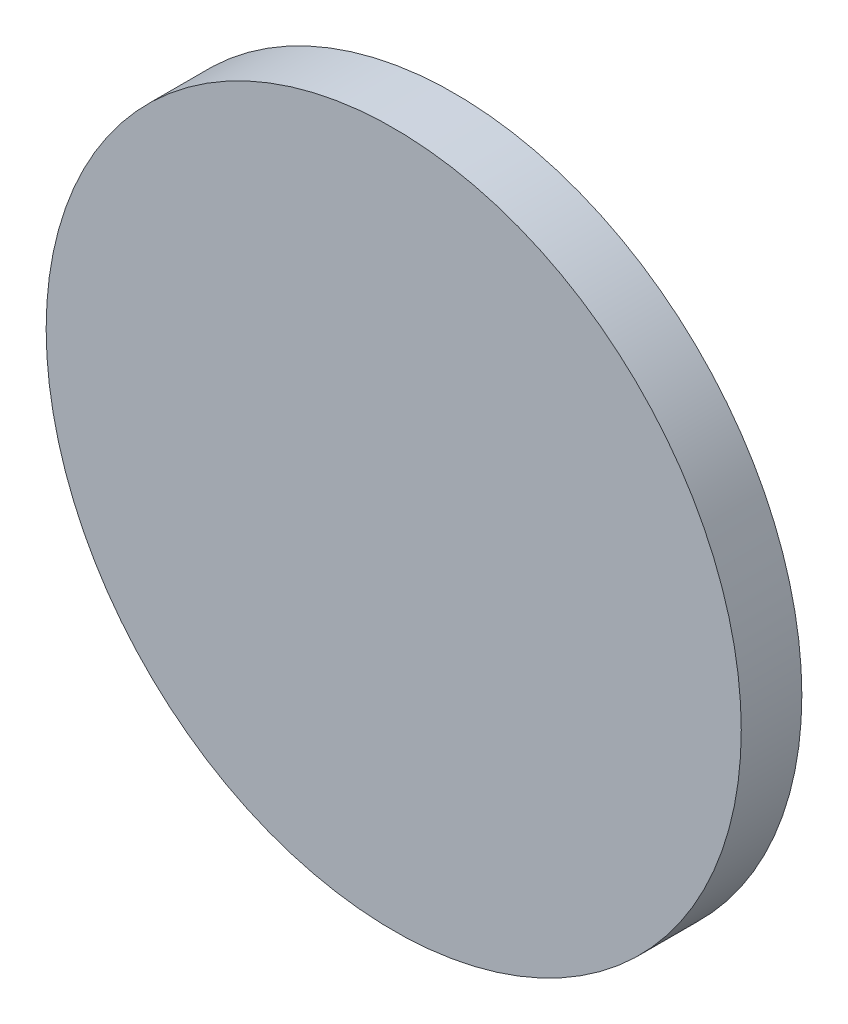
ISO-10303-21;
HEADER;
FILE_DESCRIPTION(('STEP AP214'),'2;1');
FILE_NAME('part.step','',(''),(''),'','','');
FILE_SCHEMA(('AUTOMOTIVE_DESIGN { 1 0 10303 214 1 1 1 1 }'));
ENDSEC;
DATA;
#1=APPLICATION_CONTEXT('core data for automotive mechanical design processes');
#2=APPLICATION_PROTOCOL_DEFINITION('international standard','automotive_design',2000,#1);
#3=PRODUCT_CONTEXT('',#1,'mechanical');
#4=PRODUCT('Part','Part','',(#3));
#5=PRODUCT_RELATED_PRODUCT_CATEGORY('part','',(#4));
#6=PRODUCT_DEFINITION_FORMATION('','',#4);
#7=PRODUCT_DEFINITION_CONTEXT('part definition',#1,'design');
#8=PRODUCT_DEFINITION('design','',#6,#7);
#9=PRODUCT_DEFINITION_SHAPE('','',#8);
#10=(LENGTH_UNIT() NAMED_UNIT(*) SI_UNIT(.MILLI.,.METRE.));
#11=(NAMED_UNIT(*) PLANE_ANGLE_UNIT() SI_UNIT($,.RADIAN.));
#12=(NAMED_UNIT(*) SI_UNIT($,.STERADIAN.) SOLID_ANGLE_UNIT());
#13=UNCERTAINTY_MEASURE_WITH_UNIT(LENGTH_MEASURE(1.E-05),#10,'distance_accuracy_value','');
#14=(GEOMETRIC_REPRESENTATION_CONTEXT(3) GLOBAL_UNCERTAINTY_ASSIGNED_CONTEXT((#13)) GLOBAL_UNIT_ASSIGNED_CONTEXT((#10,
#11,#12)) REPRESENTATION_CONTEXT('',''));
#15=CARTESIAN_POINT('',(0.,0.,0.));
#16=DIRECTION('',(0.,0.,1.));
#17=DIRECTION('',(1.,0.,0.));
#18=AXIS2_PLACEMENT_3D('',#15,#16,#17);
#19=CARTESIAN_POINT('',(0.,0.,-10.));
#20=DIRECTION('',(0.,0.,1.));
#21=DIRECTION('',(1.,0.,0.));
#22=AXIS2_PLACEMENT_3D('',#19,#20,#21);
#23=CYLINDRICAL_SURFACE('',#22,57.3785000000004);
#24=CARTESIAN_POINT('',(0.,0.,-10.));
#25=DIRECTION('',(0.,0.,1.));
#26=DIRECTION('',(1.,0.,0.));
#27=AXIS2_PLACEMENT_3D('',#24,#25,#26);
#28=CIRCLE('',#27,57.3785000000004);
#29=CARTESIAN_POINT('',(57.3785000000004,0.,-10.));
#30=VERTEX_POINT('',#29);
#31=EDGE_CURVE('E10',#30,#30,#28,.T.);
#32=ORIENTED_EDGE('',*,*,#31,.T.);
#33=EDGE_LOOP('',(#32));
#34=FACE_BOUND('',#33,.T.);
#35=CARTESIAN_POINT('',(0.,0.,0.));
#36=DIRECTION('',(0.,0.,1.));
#37=DIRECTION('',(1.,0.,0.));
#38=AXIS2_PLACEMENT_3D('',#35,#36,#37);
#39=CIRCLE('',#38,57.3785000000004);
#40=CARTESIAN_POINT('',(57.3785000000004,0.,0.));
#41=VERTEX_POINT('',#40);
#42=EDGE_CURVE('E33',#41,#41,#39,.T.);
#43=ORIENTED_EDGE('',*,*,#42,.F.);
#44=EDGE_LOOP('',(#43));
#45=FACE_BOUND('',#44,.T.);
#46=ADVANCED_FACE('F30',(#34,#45),#23,.T.);
#47=CARTESIAN_POINT('',(0.,0.,-10.));
#48=DIRECTION('',(0.,0.,1.));
#49=DIRECTION('',(1.,0.,0.));
#50=AXIS2_PLACEMENT_3D('',#47,#48,#49);
#51=PLANE('',#50);
#52=ORIENTED_EDGE('',*,*,#31,.F.);
#53=EDGE_LOOP('',(#52));
#54=FACE_BOUND('',#53,.T.);
#55=ADVANCED_FACE('F45',(#54),#51,.F.);
#56=CARTESIAN_POINT('',(0.,0.,0.));
#57=DIRECTION('',(0.,0.,1.));
#58=DIRECTION('',(1.,0.,0.));
#59=AXIS2_PLACEMENT_3D('',#56,#57,#58);
#60=PLANE('',#59);
#61=ORIENTED_EDGE('',*,*,#42,.T.);
#62=EDGE_LOOP('',(#61));
#63=FACE_BOUND('',#62,.T.);
#64=ADVANCED_FACE('F42',(#63),#60,.T.);
#65=CLOSED_SHELL('',(#46,#55,#64));
#66=MANIFOLD_SOLID_BREP('B2',#65);
#67=ADVANCED_BREP_SHAPE_REPRESENTATION('',(#18,#66),#14);
#68=SHAPE_DEFINITION_REPRESENTATION(#9,#67);
ENDSEC;
END-ISO-10303-21;
